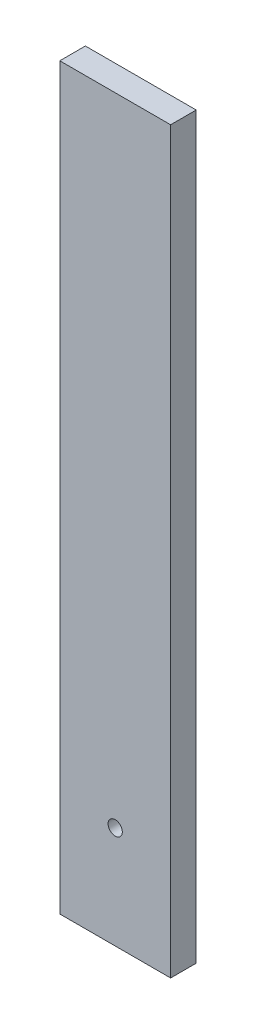
ISO-10303-21;
HEADER;
FILE_DESCRIPTION(('STEP AP214'),'2;1');
FILE_NAME('part.step','',(''),(''),'','','');
FILE_SCHEMA(('AUTOMOTIVE_DESIGN { 1 0 10303 214 1 1 1 1 }'));
ENDSEC;
DATA;
#1=APPLICATION_CONTEXT('core data for automotive mechanical design processes');
#2=APPLICATION_PROTOCOL_DEFINITION('international standard','automotive_design',2000,#1);
#3=PRODUCT_CONTEXT('',#1,'mechanical');
#4=PRODUCT('Part','Part','',(#3));
#5=PRODUCT_RELATED_PRODUCT_CATEGORY('part','',(#4));
#6=PRODUCT_DEFINITION_FORMATION('','',#4);
#7=PRODUCT_DEFINITION_CONTEXT('part definition',#1,'design');
#8=PRODUCT_DEFINITION('design','',#6,#7);
#9=PRODUCT_DEFINITION_SHAPE('','',#8);
#10=(LENGTH_UNIT() NAMED_UNIT(*) SI_UNIT(.MILLI.,.METRE.));
#11=(NAMED_UNIT(*) PLANE_ANGLE_UNIT() SI_UNIT($,.RADIAN.));
#12=(NAMED_UNIT(*) SI_UNIT($,.STERADIAN.) SOLID_ANGLE_UNIT());
#13=UNCERTAINTY_MEASURE_WITH_UNIT(LENGTH_MEASURE(1.E-05),#10,'distance_accuracy_value','');
#14=(GEOMETRIC_REPRESENTATION_CONTEXT(3) GLOBAL_UNCERTAINTY_ASSIGNED_CONTEXT((#13)) GLOBAL_UNIT_ASSIGNED_CONTEXT((#10,
#11,#12)) REPRESENTATION_CONTEXT('',''));
#15=CARTESIAN_POINT('',(0.,0.,0.));
#16=DIRECTION('',(0.,0.,1.));
#17=DIRECTION('',(1.,0.,0.));
#18=AXIS2_PLACEMENT_3D('',#15,#16,#17);
#19=CARTESIAN_POINT('',(97.5,1300.,-22.5));
#20=DIRECTION('',(-1.,0.,0.));
#21=DIRECTION('',(0.,0.,1.));
#22=AXIS2_PLACEMENT_3D('',#19,#20,#21);
#23=PLANE('',#22);
#24=DIRECTION('',(0.,0.,-1.));
#25=VECTOR('',#24,1.);
#26=CARTESIAN_POINT('',(97.5,0.,-22.5));
#27=LINE('',#26,#25);
#28=CARTESIAN_POINT('',(97.5,0.,22.5));
#29=VERTEX_POINT('',#28);
#30=CARTESIAN_POINT('',(97.5,0.,-22.5));
#31=VERTEX_POINT('',#30);
#32=EDGE_CURVE('E96',#29,#31,#27,.T.);
#33=ORIENTED_EDGE('',*,*,#32,.T.);
#34=DIRECTION('',(0.,-1.,0.));
#35=VECTOR('',#34,1.);
#36=CARTESIAN_POINT('',(97.5,1300.,-22.5));
#37=LINE('',#36,#35);
#38=CARTESIAN_POINT('',(97.5,1300.,-22.5));
#39=VERTEX_POINT('',#38);
#40=EDGE_CURVE('E11',#39,#31,#37,.T.);
#41=ORIENTED_EDGE('',*,*,#40,.F.);
#42=DIRECTION('',(0.,0.,-1.));
#43=VECTOR('',#42,1.);
#44=CARTESIAN_POINT('',(97.5,1300.,-22.5));
#45=LINE('',#44,#43);
#46=CARTESIAN_POINT('',(97.5,1300.,22.5));
#47=VERTEX_POINT('',#46);
#48=EDGE_CURVE('E84',#47,#39,#45,.T.);
#49=ORIENTED_EDGE('',*,*,#48,.F.);
#50=DIRECTION('',(0.,-1.,0.));
#51=VECTOR('',#50,1.);
#52=CARTESIAN_POINT('',(97.5,1300.,22.5));
#53=LINE('',#52,#51);
#54=EDGE_CURVE('E92',#47,#29,#53,.T.);
#55=ORIENTED_EDGE('',*,*,#54,.T.);
#56=EDGE_LOOP('',(#33,#41,#49,#55));
#57=FACE_BOUND('',#56,.T.);
#58=ADVANCED_FACE('F33',(#57),#23,.F.);
#59=CARTESIAN_POINT('',(-97.5,1300.,-22.5));
#60=DIRECTION('',(0.,0.,1.));
#61=DIRECTION('',(1.,0.,0.));
#62=AXIS2_PLACEMENT_3D('',#59,#60,#61);
#63=PLANE('',#62);
#64=CARTESIAN_POINT('',(0.,180.,-22.5));
#65=DIRECTION('',(0.,0.,1.));
#66=DIRECTION('',(1.,0.,0.));
#67=AXIS2_PLACEMENT_3D('',#64,#65,#66);
#68=CIRCLE('',#67,12.5);
#69=CARTESIAN_POINT('',(12.5,180.,-22.5));
#70=VERTEX_POINT('',#69);
#71=EDGE_CURVE('E99',#70,#70,#68,.F.);
#72=ORIENTED_EDGE('',*,*,#71,.F.);
#73=EDGE_LOOP('',(#72));
#74=FACE_BOUND('',#73,.T.);
#75=DIRECTION('',(-1.,0.,0.));
#76=VECTOR('',#75,1.);
#77=CARTESIAN_POINT('',(-97.5,0.,-22.5));
#78=LINE('',#77,#76);
#79=CARTESIAN_POINT('',(-97.5,0.,-22.5));
#80=VERTEX_POINT('',#79);
#81=EDGE_CURVE('E88',#31,#80,#78,.T.);
#82=ORIENTED_EDGE('',*,*,#81,.T.);
#83=DIRECTION('',(0.,-1.,0.));
#84=VECTOR('',#83,1.);
#85=CARTESIAN_POINT('',(-97.5,1300.,-22.5));
#86=LINE('',#85,#84);
#87=CARTESIAN_POINT('',(-97.5,1300.,-22.5));
#88=VERTEX_POINT('',#87);
#89=EDGE_CURVE('E41',#88,#80,#86,.T.);
#90=ORIENTED_EDGE('',*,*,#89,.F.);
#91=DIRECTION('',(-1.,0.,0.));
#92=VECTOR('',#91,1.);
#93=CARTESIAN_POINT('',(-97.5,1300.,-22.5));
#94=LINE('',#93,#92);
#95=EDGE_CURVE('E79',#39,#88,#94,.T.);
#96=ORIENTED_EDGE('',*,*,#95,.F.);
#97=ORIENTED_EDGE('',*,*,#40,.T.);
#98=EDGE_LOOP('',(#82,#90,#96,#97));
#99=FACE_BOUND('',#98,.T.);
#100=ADVANCED_FACE('F87',(#74,#99),#63,.F.);
#101=CARTESIAN_POINT('',(-97.5,1300.,-22.5));
#102=DIRECTION('',(1.,0.,0.));
#103=DIRECTION('',(0.,0.,-1.));
#104=AXIS2_PLACEMENT_3D('',#101,#102,#103);
#105=PLANE('',#104);
#106=DIRECTION('',(0.,0.,1.));
#107=VECTOR('',#106,1.);
#108=CARTESIAN_POINT('',(-97.5,0.,-22.5));
#109=LINE('',#108,#107);
#110=CARTESIAN_POINT('',(-97.5,0.,22.5));
#111=VERTEX_POINT('',#110);
#112=EDGE_CURVE('E66',#80,#111,#109,.T.);
#113=ORIENTED_EDGE('',*,*,#112,.T.);
#114=DIRECTION('',(0.,-1.,0.));
#115=VECTOR('',#114,1.);
#116=CARTESIAN_POINT('',(-97.5,1300.,22.5));
#117=LINE('',#116,#115);
#118=CARTESIAN_POINT('',(-97.5,1300.,22.5));
#119=VERTEX_POINT('',#118);
#120=EDGE_CURVE('E89',#119,#111,#117,.T.);
#121=ORIENTED_EDGE('',*,*,#120,.F.);
#122=DIRECTION('',(0.,0.,1.));
#123=VECTOR('',#122,1.);
#124=CARTESIAN_POINT('',(-97.5,1300.,-22.5));
#125=LINE('',#124,#123);
#126=EDGE_CURVE('E82',#88,#119,#125,.T.);
#127=ORIENTED_EDGE('',*,*,#126,.F.);
#128=ORIENTED_EDGE('',*,*,#89,.T.);
#129=EDGE_LOOP('',(#113,#121,#127,#128));
#130=FACE_BOUND('',#129,.T.);
#131=ADVANCED_FACE('F90',(#130),#105,.F.);
#132=CARTESIAN_POINT('',(-97.5,1300.,22.5));
#133=DIRECTION('',(0.,0.,-1.));
#134=DIRECTION('',(-1.,0.,0.));
#135=AXIS2_PLACEMENT_3D('',#132,#133,#134);
#136=PLANE('',#135);
#137=CARTESIAN_POINT('',(0.,180.,22.5));
#138=DIRECTION('',(0.,0.,1.));
#139=DIRECTION('',(1.,0.,0.));
#140=AXIS2_PLACEMENT_3D('',#137,#138,#139);
#141=CIRCLE('',#140,12.5);
#142=CARTESIAN_POINT('',(12.5,180.,22.5));
#143=VERTEX_POINT('',#142);
#144=EDGE_CURVE('E112',#143,#143,#141,.T.);
#145=ORIENTED_EDGE('',*,*,#144,.F.);
#146=EDGE_LOOP('',(#145));
#147=FACE_BOUND('',#146,.T.);
#148=DIRECTION('',(1.,0.,0.));
#149=VECTOR('',#148,1.);
#150=CARTESIAN_POINT('',(-97.5,0.,22.5));
#151=LINE('',#150,#149);
#152=EDGE_CURVE('E72',#111,#29,#151,.T.);
#153=ORIENTED_EDGE('',*,*,#152,.T.);
#154=ORIENTED_EDGE('',*,*,#54,.F.);
#155=DIRECTION('',(1.,0.,0.));
#156=VECTOR('',#155,1.);
#157=CARTESIAN_POINT('',(-97.5,1300.,22.5));
#158=LINE('',#157,#156);
#159=EDGE_CURVE('E49',#119,#47,#158,.T.);
#160=ORIENTED_EDGE('',*,*,#159,.F.);
#161=ORIENTED_EDGE('',*,*,#120,.T.);
#162=EDGE_LOOP('',(#153,#154,#160,#161));
#163=FACE_BOUND('',#162,.T.);
#164=ADVANCED_FACE('F104',(#147,#163),#136,.F.);
#165=CARTESIAN_POINT('',(0.,1300.,0.));
#166=DIRECTION('',(0.,1.,0.));
#167=DIRECTION('',(0.,0.,1.));
#168=AXIS2_PLACEMENT_3D('',#165,#166,#167);
#169=PLANE('',#168);
#170=ORIENTED_EDGE('',*,*,#48,.T.);
#171=ORIENTED_EDGE('',*,*,#95,.T.);
#172=ORIENTED_EDGE('',*,*,#126,.T.);
#173=ORIENTED_EDGE('',*,*,#159,.T.);
#174=EDGE_LOOP('',(#170,#171,#172,#173));
#175=FACE_BOUND('',#174,.T.);
#176=ADVANCED_FACE('F80',(#175),#169,.T.);
#177=CARTESIAN_POINT('',(0.,0.,0.));
#178=DIRECTION('',(0.,1.,0.));
#179=DIRECTION('',(0.,0.,1.));
#180=AXIS2_PLACEMENT_3D('',#177,#178,#179);
#181=PLANE('',#180);
#182=ORIENTED_EDGE('',*,*,#32,.F.);
#183=ORIENTED_EDGE('',*,*,#152,.F.);
#184=ORIENTED_EDGE('',*,*,#112,.F.);
#185=ORIENTED_EDGE('',*,*,#81,.F.);
#186=EDGE_LOOP('',(#182,#183,#184,#185));
#187=FACE_BOUND('',#186,.T.);
#188=ADVANCED_FACE('F107',(#187),#181,.F.);
#189=CARTESIAN_POINT('',(0.,180.,-22.501));
#190=DIRECTION('',(0.,0.,1.));
#191=DIRECTION('',(1.,0.,0.));
#192=AXIS2_PLACEMENT_3D('',#189,#190,#191);
#193=CYLINDRICAL_SURFACE('',#192,12.5);
#194=ORIENTED_EDGE('',*,*,#144,.T.);
#195=EDGE_LOOP('',(#194));
#196=FACE_BOUND('',#195,.T.);
#197=ORIENTED_EDGE('',*,*,#71,.T.);
#198=EDGE_LOOP('',(#197));
#199=FACE_BOUND('',#198,.T.);
#200=ADVANCED_FACE('F116',(#196,#199),#193,.F.);
#201=CLOSED_SHELL('',(#58,#100,#131,#164,#176,#188,#200));
#202=MANIFOLD_SOLID_BREP('B2',#201);
#203=ADVANCED_BREP_SHAPE_REPRESENTATION('',(#18,#202),#14);
#204=SHAPE_DEFINITION_REPRESENTATION(#9,#203);
ENDSEC;
END-ISO-10303-21;
